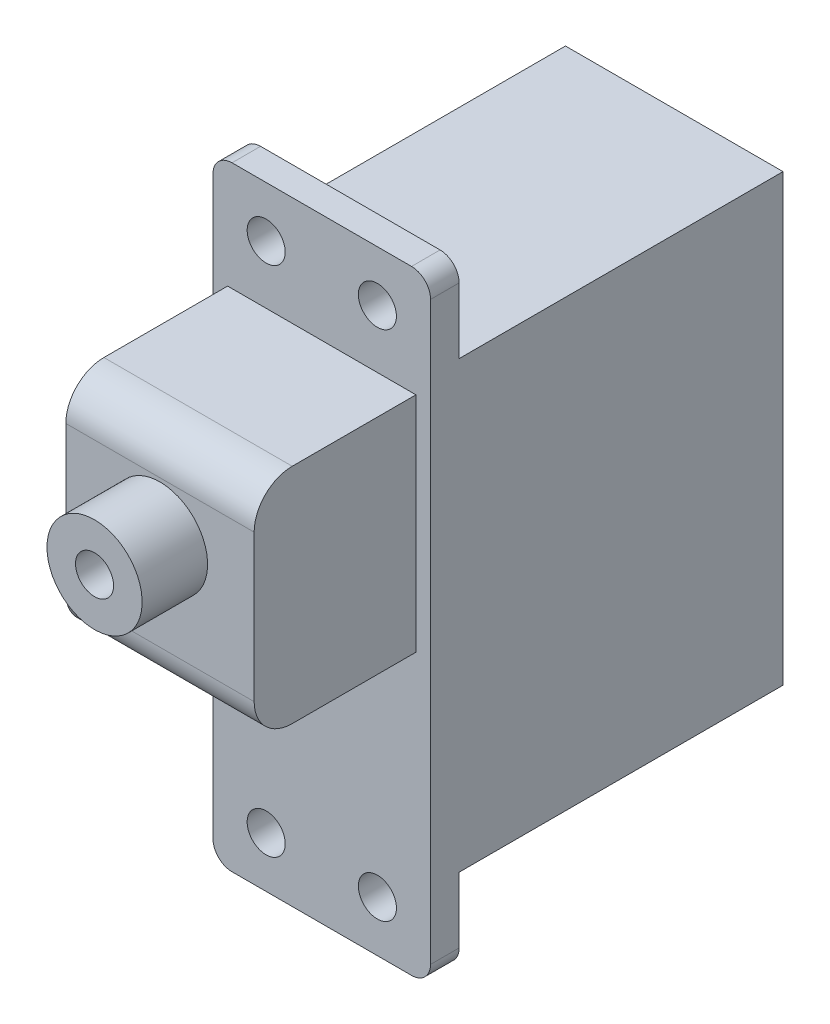
ISO-10303-21;
HEADER;
FILE_DESCRIPTION(('STEP AP214'),'2;1');
FILE_NAME('part.step','',(''),(''),'','','');
FILE_SCHEMA(('AUTOMOTIVE_DESIGN { 1 0 10303 214 1 1 1 1 }'));
ENDSEC;
DATA;
#1=APPLICATION_CONTEXT('core data for automotive mechanical design processes');
#2=APPLICATION_PROTOCOL_DEFINITION('international standard','automotive_design',2000,#1);
#3=PRODUCT_CONTEXT('',#1,'mechanical');
#4=PRODUCT('Part','Part','',(#3));
#5=PRODUCT_RELATED_PRODUCT_CATEGORY('part','',(#4));
#6=PRODUCT_DEFINITION_FORMATION('','',#4);
#7=PRODUCT_DEFINITION_CONTEXT('part definition',#1,'design');
#8=PRODUCT_DEFINITION('design','',#6,#7);
#9=PRODUCT_DEFINITION_SHAPE('','',#8);
#10=(LENGTH_UNIT() NAMED_UNIT(*) SI_UNIT(.MILLI.,.METRE.));
#11=(NAMED_UNIT(*) PLANE_ANGLE_UNIT() SI_UNIT($,.RADIAN.));
#12=(NAMED_UNIT(*) SI_UNIT($,.STERADIAN.) SOLID_ANGLE_UNIT());
#13=UNCERTAINTY_MEASURE_WITH_UNIT(LENGTH_MEASURE(1.E-05),#10,'distance_accuracy_value','');
#14=(GEOMETRIC_REPRESENTATION_CONTEXT(3) GLOBAL_UNCERTAINTY_ASSIGNED_CONTEXT((#13)) GLOBAL_UNIT_ASSIGNED_CONTEXT((#10,
#11,#12)) REPRESENTATION_CONTEXT('',''));
#15=CARTESIAN_POINT('',(0.,0.,0.));
#16=DIRECTION('',(0.,0.,1.));
#17=DIRECTION('',(1.,0.,0.));
#18=AXIS2_PLACEMENT_3D('',#15,#16,#17);
#19=CARTESIAN_POINT('',(0.,27.813,1.5));
#20=DIRECTION('',(0.,0.,1.));
#21=DIRECTION('',(1.,0.,0.));
#22=AXIS2_PLACEMENT_3D('',#19,#20,#21);
#23=PLANE('',#22);
#24=CARTESIAN_POINT('',(2.794,-1.778,1.5));
#25=DIRECTION('',(0.,0.,1.));
#26=DIRECTION('',(1.,0.,0.));
#27=AXIS2_PLACEMENT_3D('',#24,#25,#26);
#28=CIRCLE('',#27,0.999999999999986);
#29=CARTESIAN_POINT('',(3.79399999999999,-1.778,1.5));
#30=VERTEX_POINT('',#29);
#31=EDGE_CURVE('E254',#30,#30,#28,.T.);
#32=ORIENTED_EDGE('',*,*,#31,.F.);
#33=EDGE_LOOP('',(#32));
#34=FACE_BOUND('',#33,.T.);
#35=CARTESIAN_POINT('',(8.636,-1.778,1.5));
#36=DIRECTION('',(0.,0.,1.));
#37=DIRECTION('',(1.,0.,0.));
#38=AXIS2_PLACEMENT_3D('',#35,#36,#37);
#39=CIRCLE('',#38,0.999999999999986);
#40=CARTESIAN_POINT('',(9.63599999999999,-1.778,1.5));
#41=VERTEX_POINT('',#40);
#42=EDGE_CURVE('E249',#41,#41,#39,.T.);
#43=ORIENTED_EDGE('',*,*,#42,.F.);
#44=EDGE_LOOP('',(#43));
#45=FACE_BOUND('',#44,.T.);
#46=CARTESIAN_POINT('',(8.636,25.146,1.5));
#47=DIRECTION('',(0.,0.,1.));
#48=DIRECTION('',(1.,0.,0.));
#49=AXIS2_PLACEMENT_3D('',#46,#47,#48);
#50=CIRCLE('',#49,0.999999999999986);
#51=CARTESIAN_POINT('',(9.63599999999999,25.146,1.5));
#52=VERTEX_POINT('',#51);
#53=EDGE_CURVE('E331',#52,#52,#50,.T.);
#54=ORIENTED_EDGE('',*,*,#53,.F.);
#55=EDGE_LOOP('',(#54));
#56=FACE_BOUND('',#55,.T.);
#57=CARTESIAN_POINT('',(2.794,25.146,1.5));
#58=DIRECTION('',(0.,0.,1.));
#59=DIRECTION('',(1.,0.,0.));
#60=AXIS2_PLACEMENT_3D('',#57,#58,#59);
#61=CIRCLE('',#60,0.999999999999986);
#62=CARTESIAN_POINT('',(3.79399999999999,25.146,1.5));
#63=VERTEX_POINT('',#62);
#64=EDGE_CURVE('E244',#63,#63,#61,.T.);
#65=ORIENTED_EDGE('',*,*,#64,.F.);
#66=EDGE_LOOP('',(#65));
#67=FACE_BOUND('',#66,.T.);
#68=DIRECTION('',(1.,0.,0.));
#69=VECTOR('',#68,1.);
#70=CARTESIAN_POINT('',(0.,-4.445,1.5));
#71=LINE('',#70,#69);
#72=CARTESIAN_POINT('',(0.999999999999996,-4.445,1.5));
#73=VERTEX_POINT('',#72);
#74=CARTESIAN_POINT('',(10.43,-4.445,1.5));
#75=VERTEX_POINT('',#74);
#76=EDGE_CURVE('E233',#73,#75,#71,.T.);
#77=ORIENTED_EDGE('',*,*,#76,.T.);
#78=CARTESIAN_POINT('',(10.43,-3.445,1.5));
#79=DIRECTION('',(0.,0.,1.));
#80=DIRECTION('',(1.,0.,0.));
#81=AXIS2_PLACEMENT_3D('',#78,#79,#80);
#82=CIRCLE('',#81,1.);
#83=CARTESIAN_POINT('',(11.43,-3.445,1.5));
#84=VERTEX_POINT('',#83);
#85=EDGE_CURVE('E278',#75,#84,#82,.T.);
#86=ORIENTED_EDGE('',*,*,#85,.T.);
#87=DIRECTION('',(0.,-1.,0.));
#88=VECTOR('',#87,1.);
#89=CARTESIAN_POINT('',(11.43,27.813,1.5));
#90=LINE('',#89,#88);
#91=CARTESIAN_POINT('',(11.43,26.813,1.5));
#92=VERTEX_POINT('',#91);
#93=EDGE_CURVE('E220',#92,#84,#90,.T.);
#94=ORIENTED_EDGE('',*,*,#93,.F.);
#95=CARTESIAN_POINT('',(10.43,26.813,1.5));
#96=DIRECTION('',(0.,0.,1.));
#97=DIRECTION('',(1.,0.,0.));
#98=AXIS2_PLACEMENT_3D('',#95,#96,#97);
#99=CIRCLE('',#98,1.);
#100=CARTESIAN_POINT('',(10.43,27.813,1.5));
#101=VERTEX_POINT('',#100);
#102=EDGE_CURVE('E274',#92,#101,#99,.T.);
#103=ORIENTED_EDGE('',*,*,#102,.T.);
#104=DIRECTION('',(1.,0.,0.));
#105=VECTOR('',#104,1.);
#106=CARTESIAN_POINT('',(0.,27.813,1.5));
#107=LINE('',#106,#105);
#108=CARTESIAN_POINT('',(0.999999999999996,27.813,1.5));
#109=VERTEX_POINT('',#108);
#110=EDGE_CURVE('E238',#109,#101,#107,.T.);
#111=ORIENTED_EDGE('',*,*,#110,.F.);
#112=CARTESIAN_POINT('',(0.999999999999997,26.813,1.5));
#113=DIRECTION('',(0.,0.,1.));
#114=DIRECTION('',(1.,0.,0.));
#115=AXIS2_PLACEMENT_3D('',#112,#113,#114);
#116=CIRCLE('',#115,1.);
#117=CARTESIAN_POINT('',(0.,26.813,1.5));
#118=VERTEX_POINT('',#117);
#119=EDGE_CURVE('E276',#109,#118,#116,.T.);
#120=ORIENTED_EDGE('',*,*,#119,.T.);
#121=DIRECTION('',(0.,-1.,0.));
#122=VECTOR('',#121,1.);
#123=CARTESIAN_POINT('',(0.,27.813,1.5));
#124=LINE('',#123,#122);
#125=CARTESIAN_POINT('',(0.,-3.445,1.5));
#126=VERTEX_POINT('',#125);
#127=EDGE_CURVE('E226',#118,#126,#124,.T.);
#128=ORIENTED_EDGE('',*,*,#127,.T.);
#129=CARTESIAN_POINT('',(0.999999999999997,-3.445,1.5));
#130=DIRECTION('',(0.,0.,1.));
#131=DIRECTION('',(1.,0.,0.));
#132=AXIS2_PLACEMENT_3D('',#129,#130,#131);
#133=CIRCLE('',#132,1.);
#134=EDGE_CURVE('E272',#126,#73,#133,.T.);
#135=ORIENTED_EDGE('',*,*,#134,.T.);
#136=EDGE_LOOP('',(#77,#86,#94,#103,#111,#120,#128,#135));
#137=FACE_BOUND('',#136,.T.);
#138=DIRECTION('',(1.,0.,0.));
#139=VECTOR('',#138,1.);
#140=CARTESIAN_POINT('',(10.661861365,10.376691472,1.5));
#141=LINE('',#140,#139);
#142=CARTESIAN_POINT('',(0.768138635,10.376691472,1.5));
#143=VERTEX_POINT('',#142);
#144=CARTESIAN_POINT('',(10.661861365,10.376691472,1.5));
#145=VERTEX_POINT('',#144);
#146=EDGE_CURVE('E160',#143,#145,#141,.T.);
#147=ORIENTED_EDGE('',*,*,#146,.F.);
#148=DIRECTION('',(0.,-1.,0.));
#149=VECTOR('',#148,1.);
#150=CARTESIAN_POINT('',(0.768138635,10.376691472,1.5));
#151=LINE('',#150,#149);
#152=CARTESIAN_POINT('',(0.768138635,22.08777337,1.5));
#153=VERTEX_POINT('',#152);
#154=EDGE_CURVE('E167',#153,#143,#151,.T.);
#155=ORIENTED_EDGE('',*,*,#154,.F.);
#156=DIRECTION('',(-1.,0.,0.));
#157=VECTOR('',#156,1.);
#158=CARTESIAN_POINT('',(0.768138635,22.08777337,1.5));
#159=LINE('',#158,#157);
#160=CARTESIAN_POINT('',(10.661861365,22.08777337,1.5));
#161=VERTEX_POINT('',#160);
#162=EDGE_CURVE('E178',#161,#153,#159,.T.);
#163=ORIENTED_EDGE('',*,*,#162,.F.);
#164=DIRECTION('',(0.,1.,0.));
#165=VECTOR('',#164,1.);
#166=CARTESIAN_POINT('',(10.661861365,22.08777337,1.5));
#167=LINE('',#166,#165);
#168=EDGE_CURVE('E176',#145,#161,#167,.T.);
#169=ORIENTED_EDGE('',*,*,#168,.F.);
#170=EDGE_LOOP('',(#147,#155,#163,#169));
#171=FACE_BOUND('',#170,.T.);
#172=ADVANCED_FACE('F33',(#34,#45,#56,#67,#137,#171),#23,.T.);
#173=CARTESIAN_POINT('',(0.,27.813,-17.018));
#174=DIRECTION('',(0.,1.,0.));
#175=DIRECTION('',(0.,0.,1.));
#176=AXIS2_PLACEMENT_3D('',#173,#174,#175);
#177=PLANE('',#176);
#178=DIRECTION('',(-1.,0.,0.));
#179=VECTOR('',#178,1.);
#180=CARTESIAN_POINT('',(11.43,27.813,7.84001408353959E-10));
#181=LINE('',#180,#179);
#182=CARTESIAN_POINT('',(10.43,27.813,7.84001408353959E-10));
#183=VERTEX_POINT('',#182);
#184=CARTESIAN_POINT('',(0.999999999999997,27.813,7.84001408353959E-10));
#185=VERTEX_POINT('',#184);
#186=EDGE_CURVE('E201',#183,#185,#181,.T.);
#187=ORIENTED_EDGE('',*,*,#186,.T.);
#188=DIRECTION('',(0.,0.,1.));
#189=VECTOR('',#188,1.);
#190=CARTESIAN_POINT('',(0.999999999999997,27.813,1.5));
#191=LINE('',#190,#189);
#192=EDGE_CURVE('E282',#185,#109,#191,.T.);
#193=ORIENTED_EDGE('',*,*,#192,.T.);
#194=ORIENTED_EDGE('',*,*,#110,.T.);
#195=DIRECTION('',(0.,0.,1.));
#196=VECTOR('',#195,1.);
#197=CARTESIAN_POINT('',(10.43,27.813,-17.018));
#198=LINE('',#197,#196);
#199=EDGE_CURVE('E280',#101,#183,#198,.F.);
#200=ORIENTED_EDGE('',*,*,#199,.T.);
#201=EDGE_LOOP('',(#187,#193,#194,#200));
#202=FACE_BOUND('',#201,.T.);
#203=ADVANCED_FACE('F398',(#202),#177,.T.);
#204=CARTESIAN_POINT('',(0.,-4.445,-17.018));
#205=DIRECTION('',(0.,0.,-1.));
#206=DIRECTION('',(-1.,0.,0.));
#207=AXIS2_PLACEMENT_3D('',#204,#205,#206);
#208=PLANE('',#207);
#209=DIRECTION('',(-1.,0.,0.));
#210=VECTOR('',#209,1.);
#211=CARTESIAN_POINT('',(11.43,23.3680000065027,-17.018));
#212=LINE('',#211,#210);
#213=CARTESIAN_POINT('',(11.43,23.3680000065027,-17.018));
#214=VERTEX_POINT('',#213);
#215=CARTESIAN_POINT('',(0.,23.3680000065027,-17.018));
#216=VERTEX_POINT('',#215);
#217=EDGE_CURVE('E196',#214,#216,#212,.T.);
#218=ORIENTED_EDGE('',*,*,#217,.F.);
#219=DIRECTION('',(0.,1.,0.));
#220=VECTOR('',#219,1.);
#221=CARTESIAN_POINT('',(11.43,-4.445,-17.018));
#222=LINE('',#221,#220);
#223=CARTESIAN_POINT('',(11.43,-6.50266559348855E-09,-17.018));
#224=VERTEX_POINT('',#223);
#225=EDGE_CURVE('E230',#224,#214,#222,.T.);
#226=ORIENTED_EDGE('',*,*,#225,.F.);
#227=DIRECTION('',(-1.,0.,0.));
#228=VECTOR('',#227,1.);
#229=CARTESIAN_POINT('',(11.43,-6.50266631629E-09,-17.018));
#230=LINE('',#229,#228);
#231=CARTESIAN_POINT('',(0.,-6.50266631629E-09,-17.018));
#232=VERTEX_POINT('',#231);
#233=EDGE_CURVE('E221',#224,#232,#230,.T.);
#234=ORIENTED_EDGE('',*,*,#233,.T.);
#235=DIRECTION('',(0.,1.,0.));
#236=VECTOR('',#235,1.);
#237=CARTESIAN_POINT('',(0.,-4.445,-17.018));
#238=LINE('',#237,#236);
#239=EDGE_CURVE('E229',#232,#216,#238,.T.);
#240=ORIENTED_EDGE('',*,*,#239,.T.);
#241=EDGE_LOOP('',(#218,#226,#234,#240));
#242=FACE_BOUND('',#241,.T.);
#243=ADVANCED_FACE('F382',(#242),#208,.T.);
#244=CARTESIAN_POINT('',(0.,-4.445,1.5));
#245=DIRECTION('',(0.,-1.,0.));
#246=DIRECTION('',(0.,0.,-1.));
#247=AXIS2_PLACEMENT_3D('',#244,#245,#246);
#248=PLANE('',#247);
#249=DIRECTION('',(-1.,0.,0.));
#250=VECTOR('',#249,1.);
#251=CARTESIAN_POINT('',(11.43,-4.445,3.92002402760383E-10));
#252=LINE('',#251,#250);
#253=CARTESIAN_POINT('',(10.43,-4.445,3.92002402760383E-10));
#254=VERTEX_POINT('',#253);
#255=CARTESIAN_POINT('',(0.999999999999997,-4.445,3.92002402760383E-10));
#256=VERTEX_POINT('',#255);
#257=EDGE_CURVE('E217',#254,#256,#252,.T.);
#258=ORIENTED_EDGE('',*,*,#257,.F.);
#259=DIRECTION('',(0.,0.,-1.));
#260=VECTOR('',#259,1.);
#261=CARTESIAN_POINT('',(10.43,-4.445,1.5));
#262=LINE('',#261,#260);
#263=EDGE_CURVE('E270',#254,#75,#262,.F.);
#264=ORIENTED_EDGE('',*,*,#263,.T.);
#265=ORIENTED_EDGE('',*,*,#76,.F.);
#266=DIRECTION('',(0.,0.,-1.));
#267=VECTOR('',#266,1.);
#268=CARTESIAN_POINT('',(0.999999999999997,-4.445,3.92002402760383E-10));
#269=LINE('',#268,#267);
#270=EDGE_CURVE('E267',#73,#256,#269,.T.);
#271=ORIENTED_EDGE('',*,*,#270,.T.);
#272=EDGE_LOOP('',(#258,#264,#265,#271));
#273=FACE_BOUND('',#272,.T.);
#274=ADVANCED_FACE('F365',(#273),#248,.T.);
#275=CARTESIAN_POINT('',(0.,0.,0.));
#276=DIRECTION('',(1.,0.,0.));
#277=DIRECTION('',(0.,0.,-1.));
#278=AXIS2_PLACEMENT_3D('',#275,#276,#277);
#279=PLANE('',#278);
#280=ORIENTED_EDGE('',*,*,#127,.F.);
#281=DIRECTION('',(0.,0.,1.));
#282=VECTOR('',#281,1.);
#283=CARTESIAN_POINT('',(0.,26.813,7.84001336073814E-10));
#284=LINE('',#283,#282);
#285=CARTESIAN_POINT('',(0.,26.813,7.84001408353959E-10));
#286=VERTEX_POINT('',#285);
#287=EDGE_CURVE('E287',#118,#286,#284,.F.);
#288=ORIENTED_EDGE('',*,*,#287,.T.);
#289=DIRECTION('',(0.,1.,0.));
#290=VECTOR('',#289,1.);
#291=CARTESIAN_POINT('',(0.,23.3680000065027,7.84001408353959E-10));
#292=LINE('',#291,#290);
#293=CARTESIAN_POINT('',(0.,23.3680000065027,7.84001408353959E-10));
#294=VERTEX_POINT('',#293);
#295=EDGE_CURVE('E193',#294,#286,#292,.T.);
#296=ORIENTED_EDGE('',*,*,#295,.F.);
#297=DIRECTION('',(0.,0.,1.));
#298=VECTOR('',#297,1.);
#299=CARTESIAN_POINT('',(0.,23.3680000065027,-17.018));
#300=LINE('',#299,#298);
#301=EDGE_CURVE('E163',#216,#294,#300,.T.);
#302=ORIENTED_EDGE('',*,*,#301,.F.);
#303=ORIENTED_EDGE('',*,*,#239,.F.);
#304=DIRECTION('',(0.,0.,-1.));
#305=VECTOR('',#304,1.);
#306=CARTESIAN_POINT('',(0.,-6.50266423218608E-09,3.92002402760383E-10));
#307=LINE('',#306,#305);
#308=CARTESIAN_POINT('',(0.,-6.50266423218608E-09,3.92002402760383E-10));
#309=VERTEX_POINT('',#308);
#310=EDGE_CURVE('E211',#309,#232,#307,.T.);
#311=ORIENTED_EDGE('',*,*,#310,.F.);
#312=DIRECTION('',(0.,1.,0.));
#313=VECTOR('',#312,1.);
#314=CARTESIAN_POINT('',(0.,-4.445,3.92002402760383E-10));
#315=LINE('',#314,#313);
#316=CARTESIAN_POINT('',(0.,-3.445,3.92002402760383E-10));
#317=VERTEX_POINT('',#316);
#318=EDGE_CURVE('E204',#317,#309,#315,.T.);
#319=ORIENTED_EDGE('',*,*,#318,.F.);
#320=DIRECTION('',(0.,0.,-1.));
#321=VECTOR('',#320,1.);
#322=CARTESIAN_POINT('',(0.,-3.445,1.5));
#323=LINE('',#322,#321);
#324=EDGE_CURVE('E285',#317,#126,#323,.F.);
#325=ORIENTED_EDGE('',*,*,#324,.T.);
#326=EDGE_LOOP('',(#280,#288,#296,#302,#303,#311,#319,#325));
#327=FACE_BOUND('',#326,.T.);
#328=ADVANCED_FACE('F376',(#327),#279,.F.);
#329=CARTESIAN_POINT('',(11.43,0.,0.));
#330=DIRECTION('',(1.,0.,0.));
#331=DIRECTION('',(0.,0.,-1.));
#332=AXIS2_PLACEMENT_3D('',#329,#330,#331);
#333=PLANE('',#332);
#334=ORIENTED_EDGE('',*,*,#93,.T.);
#335=DIRECTION('',(0.,0.,-1.));
#336=VECTOR('',#335,1.);
#337=CARTESIAN_POINT('',(11.43,-3.445,0.));
#338=LINE('',#337,#336);
#339=CARTESIAN_POINT('',(11.43,-3.445,3.92002402760383E-10));
#340=VERTEX_POINT('',#339);
#341=EDGE_CURVE('E260',#84,#340,#338,.T.);
#342=ORIENTED_EDGE('',*,*,#341,.T.);
#343=DIRECTION('',(0.,1.,0.));
#344=VECTOR('',#343,1.);
#345=CARTESIAN_POINT('',(11.43,-4.445,3.92002402760383E-10));
#346=LINE('',#345,#344);
#347=CARTESIAN_POINT('',(11.43,-6.50266423218608E-09,3.92002402760383E-10));
#348=VERTEX_POINT('',#347);
#349=EDGE_CURVE('E208',#340,#348,#346,.T.);
#350=ORIENTED_EDGE('',*,*,#349,.T.);
#351=DIRECTION('',(0.,0.,-1.));
#352=VECTOR('',#351,1.);
#353=CARTESIAN_POINT('',(11.43,-6.50266423218608E-09,3.92002402760383E-10));
#354=LINE('',#353,#352);
#355=EDGE_CURVE('E210',#348,#224,#354,.T.);
#356=ORIENTED_EDGE('',*,*,#355,.T.);
#357=ORIENTED_EDGE('',*,*,#225,.T.);
#358=DIRECTION('',(0.,0.,1.));
#359=VECTOR('',#358,1.);
#360=CARTESIAN_POINT('',(11.43,23.3680000065027,-17.018));
#361=LINE('',#360,#359);
#362=CARTESIAN_POINT('',(11.43,23.3680000065027,7.84001408356165E-10));
#363=VERTEX_POINT('',#362);
#364=EDGE_CURVE('E189',#214,#363,#361,.T.);
#365=ORIENTED_EDGE('',*,*,#364,.T.);
#366=DIRECTION('',(0.,1.,0.));
#367=VECTOR('',#366,1.);
#368=CARTESIAN_POINT('',(11.43,23.3680000065027,7.84001408353959E-10));
#369=LINE('',#368,#367);
#370=CARTESIAN_POINT('',(11.43,26.813,7.84001408353959E-10));
#371=VERTEX_POINT('',#370);
#372=EDGE_CURVE('E192',#363,#371,#369,.T.);
#373=ORIENTED_EDGE('',*,*,#372,.T.);
#374=DIRECTION('',(0.,0.,1.));
#375=VECTOR('',#374,1.);
#376=CARTESIAN_POINT('',(11.43,26.813,0.));
#377=LINE('',#376,#375);
#378=EDGE_CURVE('E241',#371,#92,#377,.T.);
#379=ORIENTED_EDGE('',*,*,#378,.T.);
#380=EDGE_LOOP('',(#334,#342,#350,#356,#357,#365,#373,#379));
#381=FACE_BOUND('',#380,.T.);
#382=ADVANCED_FACE('F347',(#381),#333,.T.);
#383=CARTESIAN_POINT('',(11.43,-4.445,3.92002402760383E-10));
#384=DIRECTION('',(0.,0.,1.));
#385=DIRECTION('',(1.,0.,0.));
#386=AXIS2_PLACEMENT_3D('',#383,#384,#385);
#387=PLANE('',#386);
#388=CARTESIAN_POINT('',(2.794,-1.778,0.));
#389=DIRECTION('',(0.,0.,-1.));
#390=DIRECTION('',(-1.,0.,0.));
#391=AXIS2_PLACEMENT_3D('',#388,#389,#390);
#392=CIRCLE('',#391,0.999999999999987);
#393=CARTESIAN_POINT('',(1.79400000000001,-1.778,0.));
#394=VERTEX_POINT('',#393);
#395=EDGE_CURVE('E257',#394,#394,#392,.T.);
#396=ORIENTED_EDGE('',*,*,#395,.F.);
#397=EDGE_LOOP('',(#396));
#398=FACE_BOUND('',#397,.T.);
#399=CARTESIAN_POINT('',(8.636,-1.778,0.));
#400=DIRECTION('',(0.,0.,-1.));
#401=DIRECTION('',(-1.,0.,0.));
#402=AXIS2_PLACEMENT_3D('',#399,#400,#401);
#403=CIRCLE('',#402,0.999999999999987);
#404=CARTESIAN_POINT('',(7.63600000000001,-1.778,0.));
#405=VERTEX_POINT('',#404);
#406=EDGE_CURVE('E253',#405,#405,#403,.T.);
#407=ORIENTED_EDGE('',*,*,#406,.F.);
#408=EDGE_LOOP('',(#407));
#409=FACE_BOUND('',#408,.T.);
#410=ORIENTED_EDGE('',*,*,#349,.F.);
#411=CARTESIAN_POINT('',(10.43,-3.445,3.92002402760383E-10));
#412=DIRECTION('',(0.,0.,1.));
#413=DIRECTION('',(1.,0.,0.));
#414=AXIS2_PLACEMENT_3D('',#411,#412,#413);
#415=CIRCLE('',#414,1.);
#416=EDGE_CURVE('E265',#340,#254,#415,.F.);
#417=ORIENTED_EDGE('',*,*,#416,.T.);
#418=ORIENTED_EDGE('',*,*,#257,.T.);
#419=CARTESIAN_POINT('',(0.999999999999997,-3.445,3.92002402760383E-10));
#420=DIRECTION('',(0.,0.,1.));
#421=DIRECTION('',(1.,0.,0.));
#422=AXIS2_PLACEMENT_3D('',#419,#420,#421);
#423=CIRCLE('',#422,1.);
#424=EDGE_CURVE('E263',#256,#317,#423,.F.);
#425=ORIENTED_EDGE('',*,*,#424,.T.);
#426=ORIENTED_EDGE('',*,*,#318,.T.);
#427=DIRECTION('',(-1.,0.,0.));
#428=VECTOR('',#427,1.);
#429=CARTESIAN_POINT('',(11.43,-6.50266423218608E-09,3.92002402760383E-10));
#430=LINE('',#429,#428);
#431=EDGE_CURVE('E214',#348,#309,#430,.T.);
#432=ORIENTED_EDGE('',*,*,#431,.F.);
#433=EDGE_LOOP('',(#410,#417,#418,#425,#426,#432));
#434=FACE_BOUND('',#433,.T.);
#435=ADVANCED_FACE('F343',(#398,#409,#434),#387,.F.);
#436=CARTESIAN_POINT('',(11.43,-6.50266423218608E-09,3.92002402760383E-10));
#437=DIRECTION('',(0.,1.,0.));
#438=DIRECTION('',(0.,0.,1.));
#439=AXIS2_PLACEMENT_3D('',#436,#437,#438);
#440=PLANE('',#439);
#441=ORIENTED_EDGE('',*,*,#310,.T.);
#442=ORIENTED_EDGE('',*,*,#233,.F.);
#443=ORIENTED_EDGE('',*,*,#355,.F.);
#444=ORIENTED_EDGE('',*,*,#431,.T.);
#445=EDGE_LOOP('',(#441,#442,#443,#444));
#446=FACE_BOUND('',#445,.T.);
#447=ADVANCED_FACE('F346',(#446),#440,.F.);
#448=CARTESIAN_POINT('',(11.43,23.3680000065027,7.84001408353959E-10));
#449=DIRECTION('',(0.,0.,1.));
#450=DIRECTION('',(1.,0.,0.));
#451=AXIS2_PLACEMENT_3D('',#448,#449,#450);
#452=PLANE('',#451);
#453=CARTESIAN_POINT('',(8.636,25.146,0.));
#454=DIRECTION('',(0.,0.,-1.));
#455=DIRECTION('',(-1.,0.,0.));
#456=AXIS2_PLACEMENT_3D('',#453,#454,#455);
#457=CIRCLE('',#456,0.999999999999987);
#458=CARTESIAN_POINT('',(7.63600000000001,25.146,0.));
#459=VERTEX_POINT('',#458);
#460=EDGE_CURVE('E252',#459,#459,#457,.T.);
#461=ORIENTED_EDGE('',*,*,#460,.F.);
#462=EDGE_LOOP('',(#461));
#463=FACE_BOUND('',#462,.T.);
#464=CARTESIAN_POINT('',(2.794,25.146,0.));
#465=DIRECTION('',(0.,0.,-1.));
#466=DIRECTION('',(-1.,0.,0.));
#467=AXIS2_PLACEMENT_3D('',#464,#465,#466);
#468=CIRCLE('',#467,0.999999999999987);
#469=CARTESIAN_POINT('',(1.79400000000001,25.146,0.));
#470=VERTEX_POINT('',#469);
#471=EDGE_CURVE('E248',#470,#470,#468,.T.);
#472=ORIENTED_EDGE('',*,*,#471,.F.);
#473=EDGE_LOOP('',(#472));
#474=FACE_BOUND('',#473,.T.);
#475=ORIENTED_EDGE('',*,*,#295,.T.);
#476=CARTESIAN_POINT('',(0.999999999999997,26.813,7.84001336073814E-10));
#477=DIRECTION('',(0.,0.,1.));
#478=DIRECTION('',(1.,0.,0.));
#479=AXIS2_PLACEMENT_3D('',#476,#477,#478);
#480=CIRCLE('',#479,1.);
#481=EDGE_CURVE('E291',#286,#185,#480,.F.);
#482=ORIENTED_EDGE('',*,*,#481,.T.);
#483=ORIENTED_EDGE('',*,*,#186,.F.);
#484=CARTESIAN_POINT('',(10.43,26.813,7.84001408353959E-10));
#485=DIRECTION('',(0.,0.,1.));
#486=DIRECTION('',(1.,0.,0.));
#487=AXIS2_PLACEMENT_3D('',#484,#485,#486);
#488=CIRCLE('',#487,1.);
#489=EDGE_CURVE('E289',#183,#371,#488,.F.);
#490=ORIENTED_EDGE('',*,*,#489,.T.);
#491=ORIENTED_EDGE('',*,*,#372,.F.);
#492=DIRECTION('',(-1.,0.,0.));
#493=VECTOR('',#492,1.);
#494=CARTESIAN_POINT('',(11.43,23.3680000065027,7.84001408353959E-10));
#495=LINE('',#494,#493);
#496=EDGE_CURVE('E205',#363,#294,#495,.T.);
#497=ORIENTED_EDGE('',*,*,#496,.T.);
#498=EDGE_LOOP('',(#475,#482,#483,#490,#491,#497));
#499=FACE_BOUND('',#498,.T.);
#500=ADVANCED_FACE('F389',(#463,#474,#499),#452,.F.);
#501=CARTESIAN_POINT('',(11.43,23.3680000065027,-17.018));
#502=DIRECTION('',(0.,-1.,0.));
#503=DIRECTION('',(0.,0.,-1.));
#504=AXIS2_PLACEMENT_3D('',#501,#502,#503);
#505=PLANE('',#504);
#506=ORIENTED_EDGE('',*,*,#301,.T.);
#507=ORIENTED_EDGE('',*,*,#496,.F.);
#508=ORIENTED_EDGE('',*,*,#364,.F.);
#509=ORIENTED_EDGE('',*,*,#217,.T.);
#510=EDGE_LOOP('',(#506,#507,#508,#509));
#511=FACE_BOUND('',#510,.T.);
#512=ADVANCED_FACE('F386',(#511),#505,.F.);
#513=CARTESIAN_POINT('',(0.768138635,10.376691472,10.));
#514=DIRECTION('',(1.,0.,0.));
#515=DIRECTION('',(0.,0.,-1.));
#516=AXIS2_PLACEMENT_3D('',#513,#514,#515);
#517=PLANE('',#516);
#518=DIRECTION('',(0.,0.,-1.));
#519=VECTOR('',#518,1.);
#520=CARTESIAN_POINT('',(0.768138635,10.376691472,10.));
#521=LINE('',#520,#519);
#522=CARTESIAN_POINT('',(0.768138635,10.376691472,8.));
#523=VERTEX_POINT('',#522);
#524=EDGE_CURVE('E156',#523,#143,#521,.T.);
#525=ORIENTED_EDGE('',*,*,#524,.F.);
#526=CARTESIAN_POINT('',(0.768138635,12.376691472,8.));
#527=DIRECTION('',(1.,0.,0.));
#528=DIRECTION('',(0.,0.,-1.));
#529=AXIS2_PLACEMENT_3D('',#526,#527,#528);
#530=CIRCLE('',#529,2.);
#531=CARTESIAN_POINT('',(0.768138635,12.376691472,10.));
#532=VERTEX_POINT('',#531);
#533=EDGE_CURVE('E41',#523,#532,#530,.F.);
#534=ORIENTED_EDGE('',*,*,#533,.T.);
#535=DIRECTION('',(0.,-1.,0.));
#536=VECTOR('',#535,1.);
#537=CARTESIAN_POINT('',(0.768138635,10.376691472,10.));
#538=LINE('',#537,#536);
#539=CARTESIAN_POINT('',(0.768138635,20.08777337,10.));
#540=VERTEX_POINT('',#539);
#541=EDGE_CURVE('E183',#540,#532,#538,.T.);
#542=ORIENTED_EDGE('',*,*,#541,.F.);
#543=CARTESIAN_POINT('',(0.768138635,20.08777337,8.));
#544=DIRECTION('',(1.,0.,0.));
#545=DIRECTION('',(0.,0.,-1.));
#546=AXIS2_PLACEMENT_3D('',#543,#544,#545);
#547=CIRCLE('',#546,2.);
#548=CARTESIAN_POINT('',(0.768138635,22.08777337,8.));
#549=VERTEX_POINT('',#548);
#550=EDGE_CURVE('E48',#540,#549,#547,.F.);
#551=ORIENTED_EDGE('',*,*,#550,.T.);
#552=DIRECTION('',(0.,0.,-1.));
#553=VECTOR('',#552,1.);
#554=CARTESIAN_POINT('',(0.768138635,22.08777337,10.));
#555=LINE('',#554,#553);
#556=EDGE_CURVE('E169',#549,#153,#555,.T.);
#557=ORIENTED_EDGE('',*,*,#556,.T.);
#558=ORIENTED_EDGE('',*,*,#154,.T.);
#559=EDGE_LOOP('',(#525,#534,#542,#551,#557,#558));
#560=FACE_BOUND('',#559,.T.);
#561=ADVANCED_FACE('F168',(#560),#517,.F.);
#562=CARTESIAN_POINT('',(10.661861365,10.376691472,10.));
#563=DIRECTION('',(0.,1.,0.));
#564=DIRECTION('',(0.,0.,1.));
#565=AXIS2_PLACEMENT_3D('',#562,#563,#564);
#566=PLANE('',#565);
#567=DIRECTION('',(0.,0.,-1.));
#568=VECTOR('',#567,1.);
#569=CARTESIAN_POINT('',(10.661861365,10.376691472,10.));
#570=LINE('',#569,#568);
#571=CARTESIAN_POINT('',(10.661861365,10.376691472,8.));
#572=VERTEX_POINT('',#571);
#573=EDGE_CURVE('E164',#572,#145,#570,.T.);
#574=ORIENTED_EDGE('',*,*,#573,.F.);
#575=DIRECTION('',(1.,0.,0.));
#576=VECTOR('',#575,1.);
#577=CARTESIAN_POINT('',(10.661861365,10.376691472,8.));
#578=LINE('',#577,#576);
#579=EDGE_CURVE('E56',#572,#523,#578,.F.);
#580=ORIENTED_EDGE('',*,*,#579,.T.);
#581=ORIENTED_EDGE('',*,*,#524,.T.);
#582=ORIENTED_EDGE('',*,*,#146,.T.);
#583=EDGE_LOOP('',(#574,#580,#581,#582));
#584=FACE_BOUND('',#583,.T.);
#585=ADVANCED_FACE('F158',(#584),#566,.F.);
#586=CARTESIAN_POINT('',(10.661861365,22.08777337,10.));
#587=DIRECTION('',(-1.,0.,0.));
#588=DIRECTION('',(0.,0.,1.));
#589=AXIS2_PLACEMENT_3D('',#586,#587,#588);
#590=PLANE('',#589);
#591=DIRECTION('',(0.,1.,0.));
#592=VECTOR('',#591,1.);
#593=CARTESIAN_POINT('',(10.661861365,22.08777337,10.));
#594=LINE('',#593,#592);
#595=CARTESIAN_POINT('',(10.661861365,12.376691472,10.));
#596=VERTEX_POINT('',#595);
#597=CARTESIAN_POINT('',(10.661861365,20.08777337,10.));
#598=VERTEX_POINT('',#597);
#599=EDGE_CURVE('E186',#596,#598,#594,.T.);
#600=ORIENTED_EDGE('',*,*,#599,.F.);
#601=CARTESIAN_POINT('',(10.661861365,12.376691472,8.));
#602=DIRECTION('',(-1.,0.,0.));
#603=DIRECTION('',(0.,0.,1.));
#604=AXIS2_PLACEMENT_3D('',#601,#602,#603);
#605=CIRCLE('',#604,2.);
#606=EDGE_CURVE('E301',#596,#572,#605,.F.);
#607=ORIENTED_EDGE('',*,*,#606,.T.);
#608=ORIENTED_EDGE('',*,*,#573,.T.);
#609=ORIENTED_EDGE('',*,*,#168,.T.);
#610=DIRECTION('',(0.,0.,-1.));
#611=VECTOR('',#610,1.);
#612=CARTESIAN_POINT('',(10.661861365,22.08777337,10.));
#613=LINE('',#612,#611);
#614=CARTESIAN_POINT('',(10.661861365,22.08777337,8.));
#615=VERTEX_POINT('',#614);
#616=EDGE_CURVE('E185',#615,#161,#613,.T.);
#617=ORIENTED_EDGE('',*,*,#616,.F.);
#618=CARTESIAN_POINT('',(10.661861365,20.08777337,8.));
#619=DIRECTION('',(-1.,0.,0.));
#620=DIRECTION('',(0.,0.,1.));
#621=AXIS2_PLACEMENT_3D('',#618,#619,#620);
#622=CIRCLE('',#621,2.);
#623=EDGE_CURVE('E299',#615,#598,#622,.F.);
#624=ORIENTED_EDGE('',*,*,#623,.T.);
#625=EDGE_LOOP('',(#600,#607,#608,#609,#617,#624));
#626=FACE_BOUND('',#625,.T.);
#627=ADVANCED_FACE('F315',(#626),#590,.F.);
#628=CARTESIAN_POINT('',(0.768138635,22.08777337,10.));
#629=DIRECTION('',(0.,-1.,0.));
#630=DIRECTION('',(1.,0.,0.));
#631=AXIS2_PLACEMENT_3D('',#628,#629,#630);
#632=PLANE('',#631);
#633=ORIENTED_EDGE('',*,*,#556,.F.);
#634=DIRECTION('',(-1.,0.,0.));
#635=VECTOR('',#634,1.);
#636=CARTESIAN_POINT('',(0.768138635,22.08777337,8.));
#637=LINE('',#636,#635);
#638=EDGE_CURVE('E11',#549,#615,#637,.F.);
#639=ORIENTED_EDGE('',*,*,#638,.T.);
#640=ORIENTED_EDGE('',*,*,#616,.T.);
#641=ORIENTED_EDGE('',*,*,#162,.T.);
#642=EDGE_LOOP('',(#633,#639,#640,#641));
#643=FACE_BOUND('',#642,.T.);
#644=ADVANCED_FACE('F442',(#643),#632,.F.);
#645=CARTESIAN_POINT('',(0.,0.,10.));
#646=DIRECTION('',(0.,0.,-1.));
#647=DIRECTION('',(-1.,0.,0.));
#648=AXIS2_PLACEMENT_3D('',#645,#646,#647);
#649=PLANE('',#648);
#650=CARTESIAN_POINT('',(5.715,17.399,10.));
#651=DIRECTION('',(0.,0.,-1.));
#652=DIRECTION('',(-1.,0.,0.));
#653=AXIS2_PLACEMENT_3D('',#650,#651,#652);
#654=CIRCLE('',#653,2.5);
#655=CARTESIAN_POINT('',(3.215,17.399,10.));
#656=VERTEX_POINT('',#655);
#657=EDGE_CURVE('E321',#656,#656,#654,.T.);
#658=ORIENTED_EDGE('',*,*,#657,.T.);
#659=EDGE_LOOP('',(#658));
#660=FACE_BOUND('',#659,.T.);
#661=ORIENTED_EDGE('',*,*,#541,.T.);
#662=DIRECTION('',(1.,0.,0.));
#663=VECTOR('',#662,1.);
#664=CARTESIAN_POINT('',(0.,12.376691472,10.));
#665=LINE('',#664,#663);
#666=EDGE_CURVE('E296',#532,#596,#665,.T.);
#667=ORIENTED_EDGE('',*,*,#666,.T.);
#668=ORIENTED_EDGE('',*,*,#599,.T.);
#669=DIRECTION('',(-1.,0.,0.));
#670=VECTOR('',#669,1.);
#671=CARTESIAN_POINT('',(0.,20.08777337,10.));
#672=LINE('',#671,#670);
#673=EDGE_CURVE('E293',#598,#540,#672,.T.);
#674=ORIENTED_EDGE('',*,*,#673,.T.);
#675=EDGE_LOOP('',(#661,#667,#668,#674));
#676=FACE_BOUND('',#675,.T.);
#677=ADVANCED_FACE('F308',(#660,#676),#649,.F.);
#678=CARTESIAN_POINT('',(5.715,17.399,13.438));
#679=DIRECTION('',(0.,0.,-1.));
#680=DIRECTION('',(-1.,0.,0.));
#681=AXIS2_PLACEMENT_3D('',#678,#679,#680);
#682=CYLINDRICAL_SURFACE('',#681,2.5);
#683=CARTESIAN_POINT('',(5.715,17.399,13.438));
#684=DIRECTION('',(0.,0.,-1.));
#685=DIRECTION('',(-1.,0.,0.));
#686=AXIS2_PLACEMENT_3D('',#683,#684,#685);
#687=CIRCLE('',#686,2.5);
#688=CARTESIAN_POINT('',(3.215,17.399,13.438));
#689=VERTEX_POINT('',#688);
#690=EDGE_CURVE('E173',#689,#689,#687,.T.);
#691=ORIENTED_EDGE('',*,*,#690,.T.);
#692=EDGE_LOOP('',(#691));
#693=FACE_BOUND('',#692,.T.);
#694=ORIENTED_EDGE('',*,*,#657,.F.);
#695=EDGE_LOOP('',(#694));
#696=FACE_BOUND('',#695,.T.);
#697=ADVANCED_FACE('F448',(#693,#696),#682,.T.);
#698=CARTESIAN_POINT('',(8.215,17.399,13.438));
#699=DIRECTION('',(0.,0.,1.));
#700=DIRECTION('',(1.,0.,0.));
#701=AXIS2_PLACEMENT_3D('',#698,#699,#700);
#702=PLANE('',#701);
#703=CARTESIAN_POINT('',(5.715,17.399,13.438));
#704=DIRECTION('',(0.,0.,1.));
#705=DIRECTION('',(1.,0.,0.));
#706=AXIS2_PLACEMENT_3D('',#703,#704,#705);
#707=CIRCLE('',#706,0.999999999999989);
#708=CARTESIAN_POINT('',(6.71499999999999,17.399,13.438));
#709=VERTEX_POINT('',#708);
#710=EDGE_CURVE('E247',#709,#709,#707,.T.);
#711=ORIENTED_EDGE('',*,*,#710,.F.);
#712=EDGE_LOOP('',(#711));
#713=FACE_BOUND('',#712,.T.);
#714=ORIENTED_EDGE('',*,*,#690,.F.);
#715=EDGE_LOOP('',(#714));
#716=FACE_BOUND('',#715,.T.);
#717=ADVANCED_FACE('F452',(#713,#716),#702,.T.);
#718=CARTESIAN_POINT('',(5.715,17.399,11.438));
#719=DIRECTION('',(0.,0.,-1.));
#720=DIRECTION('',(-1.,0.,0.));
#721=AXIS2_PLACEMENT_3D('',#718,#719,#720);
#722=PLANE('',#721);
#723=CARTESIAN_POINT('',(5.715,17.399,11.438));
#724=DIRECTION('',(0.,0.,1.));
#725=DIRECTION('',(1.,0.,0.));
#726=AXIS2_PLACEMENT_3D('',#723,#724,#725);
#727=CIRCLE('',#726,0.999999999999987);
#728=CARTESIAN_POINT('',(6.71499999999999,17.399,11.438));
#729=VERTEX_POINT('',#728);
#730=EDGE_CURVE('E324',#729,#729,#727,.T.);
#731=ORIENTED_EDGE('',*,*,#730,.T.);
#732=EDGE_LOOP('',(#731));
#733=FACE_BOUND('',#732,.T.);
#734=ADVANCED_FACE('F456',(#733),#722,.F.);
#735=CARTESIAN_POINT('',(5.715,17.399,13.438));
#736=DIRECTION('',(0.,0.,1.));
#737=DIRECTION('',(1.,0.,0.));
#738=AXIS2_PLACEMENT_3D('',#735,#736,#737);
#739=CYLINDRICAL_SURFACE('',#738,0.999999999999988);
#740=ORIENTED_EDGE('',*,*,#730,.F.);
#741=EDGE_LOOP('',(#740));
#742=FACE_BOUND('',#741,.T.);
#743=ORIENTED_EDGE('',*,*,#710,.T.);
#744=EDGE_LOOP('',(#743));
#745=FACE_BOUND('',#744,.T.);
#746=ADVANCED_FACE('F460',(#742,#745),#739,.F.);
#747=CARTESIAN_POINT('',(2.794,25.146,0.));
#748=DIRECTION('',(0.,0.,-1.));
#749=DIRECTION('',(-1.,0.,0.));
#750=AXIS2_PLACEMENT_3D('',#747,#748,#749);
#751=CYLINDRICAL_SURFACE('',#750,0.999999999999986);
#752=ORIENTED_EDGE('',*,*,#64,.T.);
#753=EDGE_LOOP('',(#752));
#754=FACE_BOUND('',#753,.T.);
#755=ORIENTED_EDGE('',*,*,#471,.T.);
#756=EDGE_LOOP('',(#755));
#757=FACE_BOUND('',#756,.T.);
#758=ADVANCED_FACE('F464',(#754,#757),#751,.F.);
#759=CARTESIAN_POINT('',(8.636,25.146,0.));
#760=DIRECTION('',(0.,0.,-1.));
#761=DIRECTION('',(-1.,0.,0.));
#762=AXIS2_PLACEMENT_3D('',#759,#760,#761);
#763=CYLINDRICAL_SURFACE('',#762,0.999999999999986);
#764=ORIENTED_EDGE('',*,*,#53,.T.);
#765=EDGE_LOOP('',(#764));
#766=FACE_BOUND('',#765,.T.);
#767=ORIENTED_EDGE('',*,*,#460,.T.);
#768=EDGE_LOOP('',(#767));
#769=FACE_BOUND('',#768,.T.);
#770=ADVANCED_FACE('F468',(#766,#769),#763,.F.);
#771=CARTESIAN_POINT('',(8.636,-1.778,0.));
#772=DIRECTION('',(0.,0.,-1.));
#773=DIRECTION('',(-1.,0.,0.));
#774=AXIS2_PLACEMENT_3D('',#771,#772,#773);
#775=CYLINDRICAL_SURFACE('',#774,0.999999999999986);
#776=ORIENTED_EDGE('',*,*,#42,.T.);
#777=EDGE_LOOP('',(#776));
#778=FACE_BOUND('',#777,.T.);
#779=ORIENTED_EDGE('',*,*,#406,.T.);
#780=EDGE_LOOP('',(#779));
#781=FACE_BOUND('',#780,.T.);
#782=ADVANCED_FACE('F472',(#778,#781),#775,.F.);
#783=CARTESIAN_POINT('',(2.794,-1.778,0.));
#784=DIRECTION('',(0.,0.,-1.));
#785=DIRECTION('',(-1.,0.,0.));
#786=AXIS2_PLACEMENT_3D('',#783,#784,#785);
#787=CYLINDRICAL_SURFACE('',#786,0.999999999999986);
#788=ORIENTED_EDGE('',*,*,#31,.T.);
#789=EDGE_LOOP('',(#788));
#790=FACE_BOUND('',#789,.T.);
#791=ORIENTED_EDGE('',*,*,#395,.T.);
#792=EDGE_LOOP('',(#791));
#793=FACE_BOUND('',#792,.T.);
#794=ADVANCED_FACE('F341',(#790,#793),#787,.F.);
#795=CARTESIAN_POINT('',(10.43,-3.445,0.));
#796=DIRECTION('',(0.,0.,-1.));
#797=DIRECTION('',(-1.,0.,0.));
#798=AXIS2_PLACEMENT_3D('',#795,#796,#797);
#799=CYLINDRICAL_SURFACE('',#798,1.);
#800=ORIENTED_EDGE('',*,*,#85,.F.);
#801=ORIENTED_EDGE('',*,*,#263,.F.);
#802=ORIENTED_EDGE('',*,*,#416,.F.);
#803=ORIENTED_EDGE('',*,*,#341,.F.);
#804=EDGE_LOOP('',(#800,#801,#802,#803));
#805=FACE_BOUND('',#804,.T.);
#806=ADVANCED_FACE('F361',(#805),#799,.T.);
#807=CARTESIAN_POINT('',(0.999999999999997,26.813,-17.018));
#808=DIRECTION('',(0.,0.,-1.));
#809=DIRECTION('',(0.,1.,0.));
#810=AXIS2_PLACEMENT_3D('',#807,#808,#809);
#811=CYLINDRICAL_SURFACE('',#810,1.);
#812=ORIENTED_EDGE('',*,*,#481,.F.);
#813=ORIENTED_EDGE('',*,*,#287,.F.);
#814=ORIENTED_EDGE('',*,*,#119,.F.);
#815=ORIENTED_EDGE('',*,*,#192,.F.);
#816=EDGE_LOOP('',(#812,#813,#814,#815));
#817=FACE_BOUND('',#816,.T.);
#818=ADVANCED_FACE('F401',(#817),#811,.T.);
#819=CARTESIAN_POINT('',(10.43,26.813,0.));
#820=DIRECTION('',(0.,0.,1.));
#821=DIRECTION('',(0.,-1.,0.));
#822=AXIS2_PLACEMENT_3D('',#819,#820,#821);
#823=CYLINDRICAL_SURFACE('',#822,1.);
#824=ORIENTED_EDGE('',*,*,#489,.F.);
#825=ORIENTED_EDGE('',*,*,#199,.F.);
#826=ORIENTED_EDGE('',*,*,#102,.F.);
#827=ORIENTED_EDGE('',*,*,#378,.F.);
#828=EDGE_LOOP('',(#824,#825,#826,#827));
#829=FACE_BOUND('',#828,.T.);
#830=ADVANCED_FACE('F395',(#829),#823,.T.);
#831=CARTESIAN_POINT('',(0.999999999999997,-3.445,1.5));
#832=DIRECTION('',(0.,0.,1.));
#833=DIRECTION('',(1.,0.,0.));
#834=AXIS2_PLACEMENT_3D('',#831,#832,#833);
#835=CYLINDRICAL_SURFACE('',#834,1.);
#836=ORIENTED_EDGE('',*,*,#134,.F.);
#837=ORIENTED_EDGE('',*,*,#324,.F.);
#838=ORIENTED_EDGE('',*,*,#424,.F.);
#839=ORIENTED_EDGE('',*,*,#270,.F.);
#840=EDGE_LOOP('',(#836,#837,#838,#839));
#841=FACE_BOUND('',#840,.T.);
#842=ADVANCED_FACE('F372',(#841),#835,.T.);
#843=CARTESIAN_POINT('',(0.,12.376691472,8.));
#844=DIRECTION('',(1.,0.,0.));
#845=DIRECTION('',(0.,0.,-1.));
#846=AXIS2_PLACEMENT_3D('',#843,#844,#845);
#847=CYLINDRICAL_SURFACE('',#846,2.);
#848=ORIENTED_EDGE('',*,*,#533,.F.);
#849=ORIENTED_EDGE('',*,*,#579,.F.);
#850=ORIENTED_EDGE('',*,*,#606,.F.);
#851=ORIENTED_EDGE('',*,*,#666,.F.);
#852=EDGE_LOOP('',(#848,#849,#850,#851));
#853=FACE_BOUND('',#852,.T.);
#854=ADVANCED_FACE('F313',(#853),#847,.T.);
#855=CARTESIAN_POINT('',(0.,20.08777337,8.));
#856=DIRECTION('',(-1.,0.,0.));
#857=DIRECTION('',(0.,-1.,0.));
#858=AXIS2_PLACEMENT_3D('',#855,#856,#857);
#859=CYLINDRICAL_SURFACE('',#858,2.);
#860=ORIENTED_EDGE('',*,*,#623,.F.);
#861=ORIENTED_EDGE('',*,*,#638,.F.);
#862=ORIENTED_EDGE('',*,*,#550,.F.);
#863=ORIENTED_EDGE('',*,*,#673,.F.);
#864=EDGE_LOOP('',(#860,#861,#862,#863));
#865=FACE_BOUND('',#864,.T.);
#866=ADVANCED_FACE('F35',(#865),#859,.T.);
#867=CLOSED_SHELL('',(#172,#203,#243,#274,#328,#382,#435,#447,#500,#512,#561,#585,#627,#644,
#677,#697,#717,#734,#746,#758,#770,#782,#794,#806,#818,#830,#842,#854,#866));
#868=MANIFOLD_SOLID_BREP('B2',#867);
#869=ADVANCED_BREP_SHAPE_REPRESENTATION('',(#18,#868),#14);
#870=SHAPE_DEFINITION_REPRESENTATION(#9,#869);
ENDSEC;
END-ISO-10303-21;
